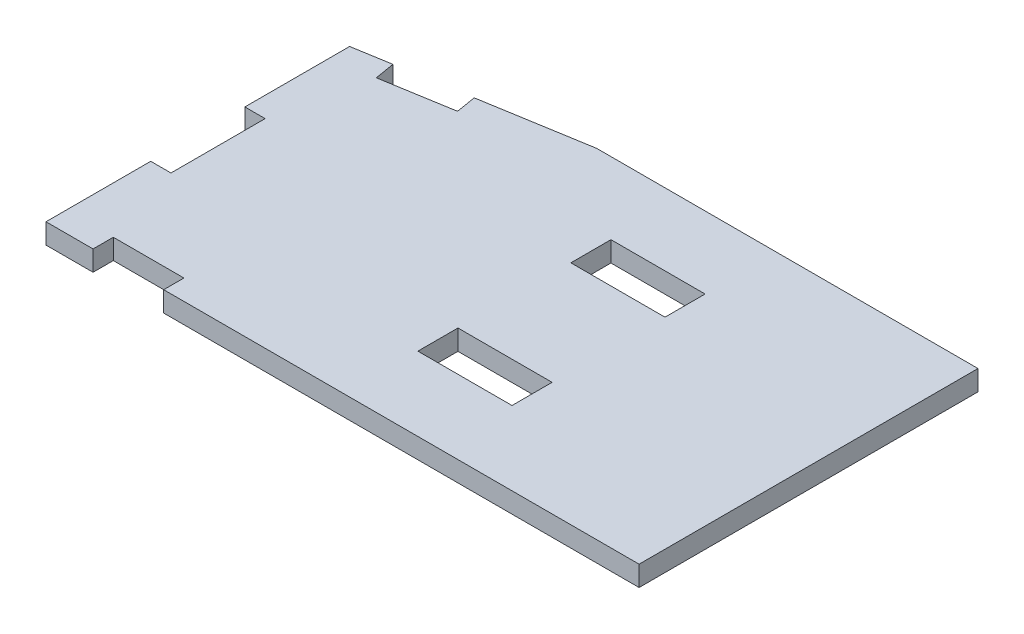
ISO-10303-21;
HEADER;
FILE_DESCRIPTION(('STEP AP214'),'2;1');
FILE_NAME('part.step','',(''),(''),'','','');
FILE_SCHEMA(('AUTOMOTIVE_DESIGN { 1 0 10303 214 1 1 1 1 }'));
ENDSEC;
DATA;
#1=APPLICATION_CONTEXT('core data for automotive mechanical design processes');
#2=APPLICATION_PROTOCOL_DEFINITION('international standard','automotive_design',2000,#1);
#3=PRODUCT_CONTEXT('',#1,'mechanical');
#4=PRODUCT('Part','Part','',(#3));
#5=PRODUCT_RELATED_PRODUCT_CATEGORY('part','',(#4));
#6=PRODUCT_DEFINITION_FORMATION('','',#4);
#7=PRODUCT_DEFINITION_CONTEXT('part definition',#1,'design');
#8=PRODUCT_DEFINITION('design','',#6,#7);
#9=PRODUCT_DEFINITION_SHAPE('','',#8);
#10=(LENGTH_UNIT() NAMED_UNIT(*) SI_UNIT(.MILLI.,.METRE.));
#11=(NAMED_UNIT(*) PLANE_ANGLE_UNIT() SI_UNIT($,.RADIAN.));
#12=(NAMED_UNIT(*) SI_UNIT($,.STERADIAN.) SOLID_ANGLE_UNIT());
#13=UNCERTAINTY_MEASURE_WITH_UNIT(LENGTH_MEASURE(1.E-05),#10,'distance_accuracy_value','');
#14=(GEOMETRIC_REPRESENTATION_CONTEXT(3) GLOBAL_UNCERTAINTY_ASSIGNED_CONTEXT((#13)) GLOBAL_UNIT_ASSIGNED_CONTEXT((#10,
#11,#12)) REPRESENTATION_CONTEXT('',''));
#15=CARTESIAN_POINT('',(0.,0.,0.));
#16=DIRECTION('',(0.,0.,1.));
#17=DIRECTION('',(1.,0.,0.));
#18=AXIS2_PLACEMENT_3D('',#15,#16,#17);
#19=CARTESIAN_POINT('',(-8.51529729729729,5.461,-51.0917837837838));
#20=DIRECTION('',(-0.164398987305357,0.,-0.986393923832144));
#21=DIRECTION('',(-0.986393923832144,0.,0.164398987305357));
#22=AXIS2_PLACEMENT_3D('',#19,#20,#21);
#23=PLANE('',#22);
#24=DIRECTION('',(0.,-1.,0.));
#25=VECTOR('',#24,1.);
#26=CARTESIAN_POINT('',(-70.6374334848631,5.461,-40.7380944191895));
#27=LINE('',#26,#25);
#28=CARTESIAN_POINT('',(-70.6374334848631,5.461,-40.7380944191895));
#29=VERTEX_POINT('',#28);
#30=CARTESIAN_POINT('',(-70.6374334848631,0.,-40.7380944191895));
#31=VERTEX_POINT('',#30);
#32=EDGE_CURVE('E291',#29,#31,#27,.T.);
#33=ORIENTED_EDGE('',*,*,#32,.F.);
#34=DIRECTION('',(0.986393923832144,0.,-0.164398987305357));
#35=VECTOR('',#34,1.);
#36=CARTESIAN_POINT('',(-8.51529729729729,5.461,-51.0917837837838));
#37=LINE('',#36,#35);
#38=CARTESIAN_POINT('',(-42.3,5.461,-45.461));
#39=VERTEX_POINT('',#38);
#40=EDGE_CURVE('E358',#29,#39,#37,.T.);
#41=ORIENTED_EDGE('',*,*,#40,.T.);
#42=DIRECTION('',(0.,-1.,0.));
#43=VECTOR('',#42,1.);
#44=CARTESIAN_POINT('',(-42.3,5.461,-45.461));
#45=LINE('',#44,#43);
#46=CARTESIAN_POINT('',(-42.3,0.,-45.461));
#47=VERTEX_POINT('',#46);
#48=EDGE_CURVE('E45',#39,#47,#45,.T.);
#49=ORIENTED_EDGE('',*,*,#48,.T.);
#50=DIRECTION('',(0.986393923832144,0.,-0.164398987305357));
#51=VECTOR('',#50,1.);
#52=CARTESIAN_POINT('',(-8.51529729729729,0.,-51.0917837837838));
#53=LINE('',#52,#51);
#54=EDGE_CURVE('E376',#31,#47,#53,.T.);
#55=ORIENTED_EDGE('',*,*,#54,.F.);
#56=EDGE_LOOP('',(#33,#41,#49,#55));
#57=FACE_BOUND('',#56,.T.);
#58=ADVANCED_FACE('F37',(#57),#23,.T.);
#59=CARTESIAN_POINT('',(-99.45,5.461,0.));
#60=DIRECTION('',(1.,0.,0.));
#61=DIRECTION('',(0.,0.,-1.));
#62=AXIS2_PLACEMENT_3D('',#59,#60,#61);
#63=PLANE('',#62);
#64=DIRECTION('',(0.,0.,1.));
#65=VECTOR('',#64,1.);
#66=CARTESIAN_POINT('',(-99.45,0.,0.));
#67=LINE('',#66,#65);
#68=CARTESIAN_POINT('',(-99.45,0.,-35.936));
#69=VERTEX_POINT('',#68);
#70=CARTESIAN_POINT('',(-99.45,0.,-7.67850000000001));
#71=VERTEX_POINT('',#70);
#72=EDGE_CURVE('E381',#69,#71,#67,.T.);
#73=ORIENTED_EDGE('',*,*,#72,.T.);
#74=DIRECTION('',(0.,-1.,0.));
#75=VECTOR('',#74,1.);
#76=CARTESIAN_POINT('',(-99.45,5.461,-7.67850000000001));
#77=LINE('',#76,#75);
#78=CARTESIAN_POINT('',(-99.45,5.461,-7.67850000000001));
#79=VERTEX_POINT('',#78);
#80=EDGE_CURVE('E287',#79,#71,#77,.T.);
#81=ORIENTED_EDGE('',*,*,#80,.F.);
#82=DIRECTION('',(0.,0.,1.));
#83=VECTOR('',#82,1.);
#84=CARTESIAN_POINT('',(-99.45,5.461,0.));
#85=LINE('',#84,#83);
#86=CARTESIAN_POINT('',(-99.45,5.461,-35.936));
#87=VERTEX_POINT('',#86);
#88=EDGE_CURVE('E363',#87,#79,#85,.T.);
#89=ORIENTED_EDGE('',*,*,#88,.F.);
#90=DIRECTION('',(0.,-1.,0.));
#91=VECTOR('',#90,1.);
#92=CARTESIAN_POINT('',(-99.45,5.461,-35.936));
#93=LINE('',#92,#91);
#94=EDGE_CURVE('E392',#87,#69,#93,.T.);
#95=ORIENTED_EDGE('',*,*,#94,.T.);
#96=EDGE_LOOP('',(#73,#81,#89,#95));
#97=FACE_BOUND('',#96,.T.);
#98=ADVANCED_FACE('F459',(#97),#63,.F.);
#99=CARTESIAN_POINT('',(0.,5.461,45.979));
#100=DIRECTION('',(0.,0.,-1.));
#101=DIRECTION('',(-1.,0.,0.));
#102=AXIS2_PLACEMENT_3D('',#99,#100,#101);
#103=PLANE('',#102);
#104=DIRECTION('',(1.,0.,0.));
#105=VECTOR('',#104,1.);
#106=CARTESIAN_POINT('',(0.,5.461,45.979));
#107=LINE('',#106,#105);
#108=CARTESIAN_POINT('',(-67.7,5.461,45.979));
#109=VERTEX_POINT('',#108);
#110=CARTESIAN_POINT('',(60.57,5.461,45.979));
#111=VERTEX_POINT('',#110);
#112=EDGE_CURVE('E366',#109,#111,#107,.T.);
#113=ORIENTED_EDGE('',*,*,#112,.F.);
#114=DIRECTION('',(0.,-1.,0.));
#115=VECTOR('',#114,1.);
#116=CARTESIAN_POINT('',(-67.7,5.461,45.979));
#117=LINE('',#116,#115);
#118=CARTESIAN_POINT('',(-67.7,0.,45.979));
#119=VERTEX_POINT('',#118);
#120=EDGE_CURVE('E337',#109,#119,#117,.T.);
#121=ORIENTED_EDGE('',*,*,#120,.T.);
#122=DIRECTION('',(1.,0.,0.));
#123=VECTOR('',#122,1.);
#124=CARTESIAN_POINT('',(0.,0.,45.979));
#125=LINE('',#124,#123);
#126=CARTESIAN_POINT('',(60.57,0.,45.979));
#127=VERTEX_POINT('',#126);
#128=EDGE_CURVE('E384',#119,#127,#125,.T.);
#129=ORIENTED_EDGE('',*,*,#128,.T.);
#130=DIRECTION('',(0.,-1.,0.));
#131=VECTOR('',#130,1.);
#132=CARTESIAN_POINT('',(60.57,5.461,45.979));
#133=LINE('',#132,#131);
#134=EDGE_CURVE('E370',#111,#127,#133,.T.);
#135=ORIENTED_EDGE('',*,*,#134,.F.);
#136=EDGE_LOOP('',(#113,#121,#129,#135));
#137=FACE_BOUND('',#136,.T.);
#138=ADVANCED_FACE('F422',(#137),#103,.F.);
#139=CARTESIAN_POINT('',(60.57,5.461,0.));
#140=DIRECTION('',(1.,0.,0.));
#141=DIRECTION('',(0.,0.,-1.));
#142=AXIS2_PLACEMENT_3D('',#139,#140,#141);
#143=PLANE('',#142);
#144=DIRECTION('',(0.,0.,1.));
#145=VECTOR('',#144,1.);
#146=CARTESIAN_POINT('',(60.57,0.,0.));
#147=LINE('',#146,#145);
#148=CARTESIAN_POINT('',(60.57,0.,-45.461));
#149=VERTEX_POINT('',#148);
#150=EDGE_CURVE('E293',#149,#127,#147,.T.);
#151=ORIENTED_EDGE('',*,*,#150,.F.);
#152=DIRECTION('',(0.,-1.,0.));
#153=VECTOR('',#152,1.);
#154=CARTESIAN_POINT('',(60.57,5.461,-45.461));
#155=LINE('',#154,#153);
#156=CARTESIAN_POINT('',(60.57,5.461,-45.461));
#157=VERTEX_POINT('',#156);
#158=EDGE_CURVE('E11',#157,#149,#155,.T.);
#159=ORIENTED_EDGE('',*,*,#158,.F.);
#160=DIRECTION('',(0.,0.,1.));
#161=VECTOR('',#160,1.);
#162=CARTESIAN_POINT('',(60.57,5.461,0.));
#163=LINE('',#162,#161);
#164=EDGE_CURVE('E351',#157,#111,#163,.T.);
#165=ORIENTED_EDGE('',*,*,#164,.T.);
#166=ORIENTED_EDGE('',*,*,#134,.T.);
#167=EDGE_LOOP('',(#151,#159,#165,#166));
#168=FACE_BOUND('',#167,.T.);
#169=ADVANCED_FACE('F39',(#168),#143,.T.);
#170=CARTESIAN_POINT('',(0.,5.461,-45.461));
#171=DIRECTION('',(0.,0.,-1.));
#172=DIRECTION('',(-1.,0.,0.));
#173=AXIS2_PLACEMENT_3D('',#170,#171,#172);
#174=PLANE('',#173);
#175=DIRECTION('',(1.,0.,0.));
#176=VECTOR('',#175,1.);
#177=CARTESIAN_POINT('',(0.,0.,-45.461));
#178=LINE('',#177,#176);
#179=EDGE_CURVE('E373',#47,#149,#178,.T.);
#180=ORIENTED_EDGE('',*,*,#179,.F.);
#181=ORIENTED_EDGE('',*,*,#48,.F.);
#182=DIRECTION('',(1.,0.,0.));
#183=VECTOR('',#182,1.);
#184=CARTESIAN_POINT('',(0.,5.461,-45.461));
#185=LINE('',#184,#183);
#186=EDGE_CURVE('E354',#39,#157,#185,.T.);
#187=ORIENTED_EDGE('',*,*,#186,.T.);
#188=ORIENTED_EDGE('',*,*,#158,.T.);
#189=EDGE_LOOP('',(#180,#181,#187,#188));
#190=FACE_BOUND('',#189,.T.);
#191=ADVANCED_FACE('F402',(#190),#174,.T.);
#192=DIRECTION('',(0.,-1.,0.));
#193=VECTOR('',#192,1.);
#194=CARTESIAN_POINT('',(-89.4282377338654,5.461,-37.6062937110224));
#195=LINE('',#194,#193);
#196=CARTESIAN_POINT('',(-89.4282377338654,5.461,-37.6062937110224));
#197=VERTEX_POINT('',#196);
#198=CARTESIAN_POINT('',(-89.4282377338654,0.,-37.6062937110224));
#199=VERTEX_POINT('',#198);
#200=EDGE_CURVE('E294',#197,#199,#195,.T.);
#201=ORIENTED_EDGE('',*,*,#200,.T.);
#202=EDGE_CURVE('E377',#69,#199,#53,.T.);
#203=ORIENTED_EDGE('',*,*,#202,.F.);
#204=ORIENTED_EDGE('',*,*,#94,.F.);
#205=EDGE_CURVE('E359',#87,#197,#37,.T.);
#206=ORIENTED_EDGE('',*,*,#205,.T.);
#207=EDGE_LOOP('',(#201,#203,#204,#206));
#208=FACE_BOUND('',#207,.T.);
#209=ADVANCED_FACE('F463',(#208),#23,.T.);
#210=CARTESIAN_POINT('',(-99.45,5.461,17.7215));
#211=VERTEX_POINT('',#210);
#212=CARTESIAN_POINT('',(-99.45,5.461,45.979));
#213=VERTEX_POINT('',#212);
#214=EDGE_CURVE('E362',#211,#213,#85,.T.);
#215=ORIENTED_EDGE('',*,*,#214,.F.);
#216=DIRECTION('',(0.,-1.,0.));
#217=VECTOR('',#216,1.);
#218=CARTESIAN_POINT('',(-99.45,5.461,17.7215));
#219=LINE('',#218,#217);
#220=CARTESIAN_POINT('',(-99.45,0.,17.7215));
#221=VERTEX_POINT('',#220);
#222=EDGE_CURVE('E320',#211,#221,#219,.T.);
#223=ORIENTED_EDGE('',*,*,#222,.T.);
#224=CARTESIAN_POINT('',(-99.45,0.,45.979));
#225=VERTEX_POINT('',#224);
#226=EDGE_CURVE('E380',#221,#225,#67,.T.);
#227=ORIENTED_EDGE('',*,*,#226,.T.);
#228=DIRECTION('',(0.,-1.,0.));
#229=VECTOR('',#228,1.);
#230=CARTESIAN_POINT('',(-99.45,5.461,45.979));
#231=LINE('',#230,#229);
#232=EDGE_CURVE('E389',#213,#225,#231,.T.);
#233=ORIENTED_EDGE('',*,*,#232,.F.);
#234=EDGE_LOOP('',(#215,#223,#227,#233));
#235=FACE_BOUND('',#234,.T.);
#236=ADVANCED_FACE('F443',(#235),#63,.F.);
#237=CARTESIAN_POINT('',(-86.75,0.,45.979));
#238=VERTEX_POINT('',#237);
#239=EDGE_CURVE('E355',#225,#238,#125,.T.);
#240=ORIENTED_EDGE('',*,*,#239,.T.);
#241=DIRECTION('',(0.,-1.,0.));
#242=VECTOR('',#241,1.);
#243=CARTESIAN_POINT('',(-86.75,5.461,45.979));
#244=LINE('',#243,#242);
#245=CARTESIAN_POINT('',(-86.75,5.461,45.979));
#246=VERTEX_POINT('',#245);
#247=EDGE_CURVE('E347',#246,#238,#244,.T.);
#248=ORIENTED_EDGE('',*,*,#247,.F.);
#249=EDGE_CURVE('E367',#213,#246,#107,.T.);
#250=ORIENTED_EDGE('',*,*,#249,.F.);
#251=ORIENTED_EDGE('',*,*,#232,.T.);
#252=EDGE_LOOP('',(#240,#248,#250,#251));
#253=FACE_BOUND('',#252,.T.);
#254=ADVANCED_FACE('F438',(#253),#103,.F.);
#255=CARTESIAN_POINT('',(0.,5.461,0.));
#256=DIRECTION('',(0.,1.,0.));
#257=DIRECTION('',(0.,0.,1.));
#258=AXIS2_PLACEMENT_3D('',#255,#256,#257);
#259=PLANE('',#258);
#260=DIRECTION('',(0.,0.,1.));
#261=VECTOR('',#260,1.);
#262=CARTESIAN_POINT('',(-19.05,5.461,26.0477));
#263=LINE('',#262,#261);
#264=CARTESIAN_POINT('',(-19.05,5.461,15.2273));
#265=VERTEX_POINT('',#264);
#266=CARTESIAN_POINT('',(-19.05,5.461,26.0477));
#267=VERTEX_POINT('',#266);
#268=EDGE_CURVE('E52',#265,#267,#263,.T.);
#269=ORIENTED_EDGE('',*,*,#268,.F.);
#270=DIRECTION('',(-1.,0.,0.));
#271=VECTOR('',#270,1.);
#272=CARTESIAN_POINT('',(6.34999999999999,5.461,15.2273));
#273=LINE('',#272,#271);
#274=CARTESIAN_POINT('',(6.34999999999999,5.461,15.2273));
#275=VERTEX_POINT('',#274);
#276=EDGE_CURVE('E224',#275,#265,#273,.T.);
#277=ORIENTED_EDGE('',*,*,#276,.F.);
#278=DIRECTION('',(0.,0.,-1.));
#279=VECTOR('',#278,1.);
#280=CARTESIAN_POINT('',(6.34999999999999,5.461,26.0477));
#281=LINE('',#280,#279);
#282=CARTESIAN_POINT('',(6.34999999999999,5.461,26.0477));
#283=VERTEX_POINT('',#282);
#284=EDGE_CURVE('E227',#283,#275,#281,.T.);
#285=ORIENTED_EDGE('',*,*,#284,.F.);
#286=DIRECTION('',(1.,0.,0.));
#287=VECTOR('',#286,1.);
#288=CARTESIAN_POINT('',(6.34999999999999,5.461,26.0477));
#289=LINE('',#288,#287);
#290=EDGE_CURVE('E233',#267,#283,#289,.T.);
#291=ORIENTED_EDGE('',*,*,#290,.F.);
#292=EDGE_LOOP('',(#269,#277,#285,#291));
#293=FACE_BOUND('',#292,.T.);
#294=DIRECTION('',(0.,0.,1.));
#295=VECTOR('',#294,1.);
#296=CARTESIAN_POINT('',(-19.05,5.461,-15.2273));
#297=LINE('',#296,#295);
#298=CARTESIAN_POINT('',(-19.05,5.461,-26.0477));
#299=VERTEX_POINT('',#298);
#300=CARTESIAN_POINT('',(-19.05,5.461,-15.2273));
#301=VERTEX_POINT('',#300);
#302=EDGE_CURVE('E60',#299,#301,#297,.T.);
#303=ORIENTED_EDGE('',*,*,#302,.F.);
#304=DIRECTION('',(-1.,0.,0.));
#305=VECTOR('',#304,1.);
#306=CARTESIAN_POINT('',(6.35,5.461,-26.0477));
#307=LINE('',#306,#305);
#308=CARTESIAN_POINT('',(6.35,5.461,-26.0477));
#309=VERTEX_POINT('',#308);
#310=EDGE_CURVE('E248',#309,#299,#307,.T.);
#311=ORIENTED_EDGE('',*,*,#310,.F.);
#312=DIRECTION('',(0.,0.,-1.));
#313=VECTOR('',#312,1.);
#314=CARTESIAN_POINT('',(6.34999999999999,5.461,-15.2273));
#315=LINE('',#314,#313);
#316=CARTESIAN_POINT('',(6.34999999999999,5.461,-15.2273));
#317=VERTEX_POINT('',#316);
#318=EDGE_CURVE('E262',#317,#309,#315,.T.);
#319=ORIENTED_EDGE('',*,*,#318,.F.);
#320=DIRECTION('',(1.,0.,0.));
#321=VECTOR('',#320,1.);
#322=CARTESIAN_POINT('',(6.34999999999999,5.461,-15.2273));
#323=LINE('',#322,#321);
#324=EDGE_CURVE('E259',#301,#317,#323,.T.);
#325=ORIENTED_EDGE('',*,*,#324,.F.);
#326=EDGE_LOOP('',(#303,#311,#319,#325));
#327=FACE_BOUND('',#326,.T.);
#328=DIRECTION('',(0.164398987305357,0.,0.986393923832144));
#329=VECTOR('',#328,1.);
#330=CARTESIAN_POINT('',(-70.6374334848631,5.461,-40.7380944191895));
#331=LINE('',#330,#329);
#332=CARTESIAN_POINT('',(-69.7396506151885,5.461,-35.3513972011422));
#333=VERTEX_POINT('',#332);
#334=EDGE_CURVE('E273',#29,#333,#331,.T.);
#335=ORIENTED_EDGE('',*,*,#334,.T.);
#336=DIRECTION('',(-0.986393923832144,0.,0.164398987305358));
#337=VECTOR('',#336,1.);
#338=CARTESIAN_POINT('',(-69.7396506151885,5.461,-35.3513972011422));
#339=LINE('',#338,#337);
#340=CARTESIAN_POINT('',(-88.5304548641909,5.461,-32.2195964929751));
#341=VERTEX_POINT('',#340);
#342=EDGE_CURVE('E276',#333,#341,#339,.T.);
#343=ORIENTED_EDGE('',*,*,#342,.T.);
#344=DIRECTION('',(-0.164398987305357,0.,-0.986393923832144));
#345=VECTOR('',#344,1.);
#346=CARTESIAN_POINT('',(-89.4282377338654,5.461,-37.6062937110224));
#347=LINE('',#346,#345);
#348=EDGE_CURVE('E280',#341,#197,#347,.T.);
#349=ORIENTED_EDGE('',*,*,#348,.T.);
#350=ORIENTED_EDGE('',*,*,#205,.F.);
#351=ORIENTED_EDGE('',*,*,#88,.T.);
#352=DIRECTION('',(1.,0.,0.));
#353=VECTOR('',#352,1.);
#354=CARTESIAN_POINT('',(-99.45,5.461,-7.67850000000001));
#355=LINE('',#354,#353);
#356=CARTESIAN_POINT('',(-93.989,5.461,-7.67850000000001));
#357=VERTEX_POINT('',#356);
#358=EDGE_CURVE('E301',#79,#357,#355,.T.);
#359=ORIENTED_EDGE('',*,*,#358,.T.);
#360=DIRECTION('',(0.,0.,1.));
#361=VECTOR('',#360,1.);
#362=CARTESIAN_POINT('',(-93.989,5.461,-7.67850000000001));
#363=LINE('',#362,#361);
#364=CARTESIAN_POINT('',(-93.989,5.461,17.7215));
#365=VERTEX_POINT('',#364);
#366=EDGE_CURVE('E304',#357,#365,#363,.T.);
#367=ORIENTED_EDGE('',*,*,#366,.T.);
#368=DIRECTION('',(-1.,0.,0.));
#369=VECTOR('',#368,1.);
#370=CARTESIAN_POINT('',(-99.45,5.461,17.7215));
#371=LINE('',#370,#369);
#372=EDGE_CURVE('E308',#365,#211,#371,.T.);
#373=ORIENTED_EDGE('',*,*,#372,.T.);
#374=ORIENTED_EDGE('',*,*,#214,.T.);
#375=ORIENTED_EDGE('',*,*,#249,.T.);
#376=DIRECTION('',(0.,0.,-1.));
#377=VECTOR('',#376,1.);
#378=CARTESIAN_POINT('',(-86.75,5.461,45.979));
#379=LINE('',#378,#377);
#380=CARTESIAN_POINT('',(-86.75,5.461,40.518));
#381=VERTEX_POINT('',#380);
#382=EDGE_CURVE('E330',#246,#381,#379,.T.);
#383=ORIENTED_EDGE('',*,*,#382,.T.);
#384=DIRECTION('',(1.,0.,0.));
#385=VECTOR('',#384,1.);
#386=CARTESIAN_POINT('',(-67.7,5.461,40.518));
#387=LINE('',#386,#385);
#388=CARTESIAN_POINT('',(-67.7,5.461,40.518));
#389=VERTEX_POINT('',#388);
#390=EDGE_CURVE('E334',#381,#389,#387,.T.);
#391=ORIENTED_EDGE('',*,*,#390,.T.);
#392=DIRECTION('',(0.,0.,1.));
#393=VECTOR('',#392,1.);
#394=CARTESIAN_POINT('',(-67.7,5.461,45.979));
#395=LINE('',#394,#393);
#396=EDGE_CURVE('E327',#389,#109,#395,.T.);
#397=ORIENTED_EDGE('',*,*,#396,.T.);
#398=ORIENTED_EDGE('',*,*,#112,.T.);
#399=ORIENTED_EDGE('',*,*,#164,.F.);
#400=ORIENTED_EDGE('',*,*,#186,.F.);
#401=ORIENTED_EDGE('',*,*,#40,.F.);
#402=EDGE_LOOP('',(#335,#343,#349,#350,#351,#359,#367,#373,#374,#375,#383,#391,#397,#398,#399,
#400,#401));
#403=FACE_BOUND('',#402,.T.);
#404=ADVANCED_FACE('F416',(#293,#327,#403),#259,.T.);
#405=CARTESIAN_POINT('',(0.,0.,0.));
#406=DIRECTION('',(0.,1.,0.));
#407=DIRECTION('',(0.,0.,1.));
#408=AXIS2_PLACEMENT_3D('',#405,#406,#407);
#409=PLANE('',#408);
#410=DIRECTION('',(-1.,0.,0.));
#411=VECTOR('',#410,1.);
#412=CARTESIAN_POINT('',(6.34999999999999,0.,15.2273));
#413=LINE('',#412,#411);
#414=CARTESIAN_POINT('',(6.34999999999999,0.,15.2273));
#415=VERTEX_POINT('',#414);
#416=CARTESIAN_POINT('',(-19.05,0.,15.2273));
#417=VERTEX_POINT('',#416);
#418=EDGE_CURVE('E211',#415,#417,#413,.T.);
#419=ORIENTED_EDGE('',*,*,#418,.T.);
#420=DIRECTION('',(0.,0.,1.));
#421=VECTOR('',#420,1.);
#422=CARTESIAN_POINT('',(-19.05,0.,26.0477));
#423=LINE('',#422,#421);
#424=CARTESIAN_POINT('',(-19.05,0.,26.0477));
#425=VERTEX_POINT('',#424);
#426=EDGE_CURVE('E205',#417,#425,#423,.T.);
#427=ORIENTED_EDGE('',*,*,#426,.T.);
#428=DIRECTION('',(1.,0.,0.));
#429=VECTOR('',#428,1.);
#430=CARTESIAN_POINT('',(6.34999999999999,0.,26.0477));
#431=LINE('',#430,#429);
#432=CARTESIAN_POINT('',(6.34999999999999,0.,26.0477));
#433=VERTEX_POINT('',#432);
#434=EDGE_CURVE('E215',#425,#433,#431,.T.);
#435=ORIENTED_EDGE('',*,*,#434,.T.);
#436=DIRECTION('',(0.,0.,-1.));
#437=VECTOR('',#436,1.);
#438=CARTESIAN_POINT('',(6.34999999999999,0.,26.0477));
#439=LINE('',#438,#437);
#440=EDGE_CURVE('E219',#433,#415,#439,.T.);
#441=ORIENTED_EDGE('',*,*,#440,.T.);
#442=EDGE_LOOP('',(#419,#427,#435,#441));
#443=FACE_BOUND('',#442,.T.);
#444=DIRECTION('',(-1.,0.,0.));
#445=VECTOR('',#444,1.);
#446=CARTESIAN_POINT('',(6.35,0.,-26.0477));
#447=LINE('',#446,#445);
#448=CARTESIAN_POINT('',(6.35,0.,-26.0477));
#449=VERTEX_POINT('',#448);
#450=CARTESIAN_POINT('',(-19.05,0.,-26.0477));
#451=VERTEX_POINT('',#450);
#452=EDGE_CURVE('E254',#449,#451,#447,.T.);
#453=ORIENTED_EDGE('',*,*,#452,.T.);
#454=DIRECTION('',(0.,0.,1.));
#455=VECTOR('',#454,1.);
#456=CARTESIAN_POINT('',(-19.05,0.,-15.2273));
#457=LINE('',#456,#455);
#458=CARTESIAN_POINT('',(-19.05,0.,-15.2273));
#459=VERTEX_POINT('',#458);
#460=EDGE_CURVE('E244',#451,#459,#457,.T.);
#461=ORIENTED_EDGE('',*,*,#460,.T.);
#462=DIRECTION('',(1.,0.,0.));
#463=VECTOR('',#462,1.);
#464=CARTESIAN_POINT('',(6.34999999999999,0.,-15.2273));
#465=LINE('',#464,#463);
#466=CARTESIAN_POINT('',(6.34999999999999,0.,-15.2273));
#467=VERTEX_POINT('',#466);
#468=EDGE_CURVE('E247',#459,#467,#465,.T.);
#469=ORIENTED_EDGE('',*,*,#468,.T.);
#470=DIRECTION('',(0.,0.,-1.));
#471=VECTOR('',#470,1.);
#472=CARTESIAN_POINT('',(6.34999999999999,0.,-15.2273));
#473=LINE('',#472,#471);
#474=EDGE_CURVE('E251',#467,#449,#473,.T.);
#475=ORIENTED_EDGE('',*,*,#474,.T.);
#476=EDGE_LOOP('',(#453,#461,#469,#475));
#477=FACE_BOUND('',#476,.T.);
#478=DIRECTION('',(-0.986393923832144,0.,0.164398987305358));
#479=VECTOR('',#478,1.);
#480=CARTESIAN_POINT('',(-69.7396506151885,0.,-35.3513972011422));
#481=LINE('',#480,#479);
#482=CARTESIAN_POINT('',(-69.7396506151885,0.,-35.3513972011421));
#483=VERTEX_POINT('',#482);
#484=CARTESIAN_POINT('',(-88.5304548641909,0.,-32.2195964929751));
#485=VERTEX_POINT('',#484);
#486=EDGE_CURVE('E286',#483,#485,#481,.T.);
#487=ORIENTED_EDGE('',*,*,#486,.F.);
#488=DIRECTION('',(0.164398987305357,0.,0.986393923832144));
#489=VECTOR('',#488,1.);
#490=CARTESIAN_POINT('',(-70.6374334848631,0.,-40.7380944191895));
#491=LINE('',#490,#489);
#492=EDGE_CURVE('E284',#31,#483,#491,.T.);
#493=ORIENTED_EDGE('',*,*,#492,.F.);
#494=ORIENTED_EDGE('',*,*,#54,.T.);
#495=ORIENTED_EDGE('',*,*,#179,.T.);
#496=ORIENTED_EDGE('',*,*,#150,.T.);
#497=ORIENTED_EDGE('',*,*,#128,.F.);
#498=DIRECTION('',(0.,0.,1.));
#499=VECTOR('',#498,1.);
#500=CARTESIAN_POINT('',(-67.7,0.,45.979));
#501=LINE('',#500,#499);
#502=CARTESIAN_POINT('',(-67.7,0.,40.518));
#503=VERTEX_POINT('',#502);
#504=EDGE_CURVE('E240',#503,#119,#501,.T.);
#505=ORIENTED_EDGE('',*,*,#504,.F.);
#506=DIRECTION('',(1.,0.,0.));
#507=VECTOR('',#506,1.);
#508=CARTESIAN_POINT('',(-67.7,0.,40.518));
#509=LINE('',#508,#507);
#510=CARTESIAN_POINT('',(-86.75,0.,40.518));
#511=VERTEX_POINT('',#510);
#512=EDGE_CURVE('E331',#511,#503,#509,.T.);
#513=ORIENTED_EDGE('',*,*,#512,.F.);
#514=DIRECTION('',(0.,0.,-1.));
#515=VECTOR('',#514,1.);
#516=CARTESIAN_POINT('',(-86.75,0.,45.979));
#517=LINE('',#516,#515);
#518=EDGE_CURVE('E339',#238,#511,#517,.T.);
#519=ORIENTED_EDGE('',*,*,#518,.F.);
#520=ORIENTED_EDGE('',*,*,#239,.F.);
#521=ORIENTED_EDGE('',*,*,#226,.F.);
#522=DIRECTION('',(-1.,0.,0.));
#523=VECTOR('',#522,1.);
#524=CARTESIAN_POINT('',(-99.45,0.,17.7215));
#525=LINE('',#524,#523);
#526=CARTESIAN_POINT('',(-93.989,0.,17.7215));
#527=VERTEX_POINT('',#526);
#528=EDGE_CURVE('E305',#527,#221,#525,.T.);
#529=ORIENTED_EDGE('',*,*,#528,.F.);
#530=DIRECTION('',(0.,0.,1.));
#531=VECTOR('',#530,1.);
#532=CARTESIAN_POINT('',(-93.989,0.,-7.67850000000001));
#533=LINE('',#532,#531);
#534=CARTESIAN_POINT('',(-93.989,0.,-7.67850000000001));
#535=VERTEX_POINT('',#534);
#536=EDGE_CURVE('E314',#535,#527,#533,.T.);
#537=ORIENTED_EDGE('',*,*,#536,.F.);
#538=DIRECTION('',(1.,0.,0.));
#539=VECTOR('',#538,1.);
#540=CARTESIAN_POINT('',(-99.45,0.,-7.67850000000001));
#541=LINE('',#540,#539);
#542=EDGE_CURVE('E312',#71,#535,#541,.T.);
#543=ORIENTED_EDGE('',*,*,#542,.F.);
#544=ORIENTED_EDGE('',*,*,#72,.F.);
#545=ORIENTED_EDGE('',*,*,#202,.T.);
#546=DIRECTION('',(-0.164398987305357,0.,-0.986393923832144));
#547=VECTOR('',#546,1.);
#548=CARTESIAN_POINT('',(-89.4282377338654,0.,-37.6062937110224));
#549=LINE('',#548,#547);
#550=EDGE_CURVE('E277',#485,#199,#549,.T.);
#551=ORIENTED_EDGE('',*,*,#550,.F.);
#552=EDGE_LOOP('',(#487,#493,#494,#495,#496,#497,#505,#513,#519,#520,#521,#529,#537,#543,#544,
#545,#551));
#553=FACE_BOUND('',#552,.T.);
#554=ADVANCED_FACE('F221',(#443,#477,#553),#409,.F.);
#555=CARTESIAN_POINT('',(-67.7,5.461,45.979));
#556=DIRECTION('',(1.,0.,0.));
#557=DIRECTION('',(0.,0.,-1.));
#558=AXIS2_PLACEMENT_3D('',#555,#556,#557);
#559=PLANE('',#558);
#560=ORIENTED_EDGE('',*,*,#504,.T.);
#561=ORIENTED_EDGE('',*,*,#120,.F.);
#562=ORIENTED_EDGE('',*,*,#396,.F.);
#563=DIRECTION('',(0.,-1.,0.));
#564=VECTOR('',#563,1.);
#565=CARTESIAN_POINT('',(-67.7,5.461,40.518));
#566=LINE('',#565,#564);
#567=EDGE_CURVE('E315',#389,#503,#566,.T.);
#568=ORIENTED_EDGE('',*,*,#567,.T.);
#569=EDGE_LOOP('',(#560,#561,#562,#568));
#570=FACE_BOUND('',#569,.T.);
#571=ADVANCED_FACE('F427',(#570),#559,.F.);
#572=CARTESIAN_POINT('',(-67.7,5.461,40.518));
#573=DIRECTION('',(0.,0.,-1.));
#574=DIRECTION('',(-1.,0.,0.));
#575=AXIS2_PLACEMENT_3D('',#572,#573,#574);
#576=PLANE('',#575);
#577=ORIENTED_EDGE('',*,*,#512,.T.);
#578=ORIENTED_EDGE('',*,*,#567,.F.);
#579=ORIENTED_EDGE('',*,*,#390,.F.);
#580=DIRECTION('',(0.,-1.,0.));
#581=VECTOR('',#580,1.);
#582=CARTESIAN_POINT('',(-86.75,5.461,40.518));
#583=LINE('',#582,#581);
#584=EDGE_CURVE('E345',#381,#511,#583,.T.);
#585=ORIENTED_EDGE('',*,*,#584,.T.);
#586=EDGE_LOOP('',(#577,#578,#579,#585));
#587=FACE_BOUND('',#586,.T.);
#588=ADVANCED_FACE('F431',(#587),#576,.F.);
#589=CARTESIAN_POINT('',(-86.75,5.461,45.979));
#590=DIRECTION('',(-1.,0.,0.));
#591=DIRECTION('',(0.,0.,1.));
#592=AXIS2_PLACEMENT_3D('',#589,#590,#591);
#593=PLANE('',#592);
#594=ORIENTED_EDGE('',*,*,#518,.T.);
#595=ORIENTED_EDGE('',*,*,#584,.F.);
#596=ORIENTED_EDGE('',*,*,#382,.F.);
#597=ORIENTED_EDGE('',*,*,#247,.T.);
#598=EDGE_LOOP('',(#594,#595,#596,#597));
#599=FACE_BOUND('',#598,.T.);
#600=ADVANCED_FACE('F433',(#599),#593,.F.);
#601=CARTESIAN_POINT('',(-99.45,5.461,-7.67850000000001));
#602=DIRECTION('',(0.,0.,-1.));
#603=DIRECTION('',(-1.,0.,0.));
#604=AXIS2_PLACEMENT_3D('',#601,#602,#603);
#605=PLANE('',#604);
#606=ORIENTED_EDGE('',*,*,#542,.T.);
#607=DIRECTION('',(0.,-1.,0.));
#608=VECTOR('',#607,1.);
#609=CARTESIAN_POINT('',(-93.989,5.461,-7.67850000000001));
#610=LINE('',#609,#608);
#611=EDGE_CURVE('E311',#357,#535,#610,.T.);
#612=ORIENTED_EDGE('',*,*,#611,.F.);
#613=ORIENTED_EDGE('',*,*,#358,.F.);
#614=ORIENTED_EDGE('',*,*,#80,.T.);
#615=EDGE_LOOP('',(#606,#612,#613,#614));
#616=FACE_BOUND('',#615,.T.);
#617=ADVANCED_FACE('F454',(#616),#605,.F.);
#618=CARTESIAN_POINT('',(-99.45,5.461,17.7215));
#619=DIRECTION('',(0.,0.,1.));
#620=DIRECTION('',(1.,0.,0.));
#621=AXIS2_PLACEMENT_3D('',#618,#619,#620);
#622=PLANE('',#621);
#623=ORIENTED_EDGE('',*,*,#528,.T.);
#624=ORIENTED_EDGE('',*,*,#222,.F.);
#625=ORIENTED_EDGE('',*,*,#372,.F.);
#626=DIRECTION('',(0.,-1.,0.));
#627=VECTOR('',#626,1.);
#628=CARTESIAN_POINT('',(-93.989,5.461,17.7215));
#629=LINE('',#628,#627);
#630=EDGE_CURVE('E323',#365,#527,#629,.T.);
#631=ORIENTED_EDGE('',*,*,#630,.T.);
#632=EDGE_LOOP('',(#623,#624,#625,#631));
#633=FACE_BOUND('',#632,.T.);
#634=ADVANCED_FACE('F448',(#633),#622,.F.);
#635=CARTESIAN_POINT('',(-93.989,5.461,-7.67850000000001));
#636=DIRECTION('',(1.,0.,0.));
#637=DIRECTION('',(0.,0.,-1.));
#638=AXIS2_PLACEMENT_3D('',#635,#636,#637);
#639=PLANE('',#638);
#640=ORIENTED_EDGE('',*,*,#536,.T.);
#641=ORIENTED_EDGE('',*,*,#630,.F.);
#642=ORIENTED_EDGE('',*,*,#366,.F.);
#643=ORIENTED_EDGE('',*,*,#611,.T.);
#644=EDGE_LOOP('',(#640,#641,#642,#643));
#645=FACE_BOUND('',#644,.T.);
#646=ADVANCED_FACE('F452',(#645),#639,.F.);
#647=CARTESIAN_POINT('',(-70.6374334848631,5.461,-40.7380944191895));
#648=DIRECTION('',(0.986393923832144,0.,-0.164398987305357));
#649=DIRECTION('',(-0.164398987305357,0.,-0.986393923832144));
#650=AXIS2_PLACEMENT_3D('',#647,#648,#649);
#651=PLANE('',#650);
#652=ORIENTED_EDGE('',*,*,#492,.T.);
#653=DIRECTION('',(0.,-1.,0.));
#654=VECTOR('',#653,1.);
#655=CARTESIAN_POINT('',(-69.7396506151885,5.461,-35.3513972011422));
#656=LINE('',#655,#654);
#657=EDGE_CURVE('E283',#333,#483,#656,.T.);
#658=ORIENTED_EDGE('',*,*,#657,.F.);
#659=ORIENTED_EDGE('',*,*,#334,.F.);
#660=ORIENTED_EDGE('',*,*,#32,.T.);
#661=EDGE_LOOP('',(#652,#658,#659,#660));
#662=FACE_BOUND('',#661,.T.);
#663=ADVANCED_FACE('F410',(#662),#651,.F.);
#664=CARTESIAN_POINT('',(-89.4282377338654,5.461,-37.6062937110224));
#665=DIRECTION('',(-0.986393923832144,0.,0.164398987305357));
#666=DIRECTION('',(0.164398987305357,0.,0.986393923832144));
#667=AXIS2_PLACEMENT_3D('',#664,#665,#666);
#668=PLANE('',#667);
#669=ORIENTED_EDGE('',*,*,#550,.T.);
#670=ORIENTED_EDGE('',*,*,#200,.F.);
#671=ORIENTED_EDGE('',*,*,#348,.F.);
#672=DIRECTION('',(0.,-1.,0.));
#673=VECTOR('',#672,1.);
#674=CARTESIAN_POINT('',(-88.5304548641909,5.461,-32.2195964929751));
#675=LINE('',#674,#673);
#676=EDGE_CURVE('E297',#341,#485,#675,.T.);
#677=ORIENTED_EDGE('',*,*,#676,.T.);
#678=EDGE_LOOP('',(#669,#670,#671,#677));
#679=FACE_BOUND('',#678,.T.);
#680=ADVANCED_FACE('F465',(#679),#668,.F.);
#681=CARTESIAN_POINT('',(-69.7396506151885,5.461,-35.3513972011422));
#682=DIRECTION('',(0.164398987305358,0.,0.986393923832144));
#683=DIRECTION('',(0.986393923832144,0.,-0.164398987305358));
#684=AXIS2_PLACEMENT_3D('',#681,#682,#683);
#685=PLANE('',#684);
#686=ORIENTED_EDGE('',*,*,#486,.T.);
#687=ORIENTED_EDGE('',*,*,#676,.F.);
#688=ORIENTED_EDGE('',*,*,#342,.F.);
#689=ORIENTED_EDGE('',*,*,#657,.T.);
#690=EDGE_LOOP('',(#686,#687,#688,#689));
#691=FACE_BOUND('',#690,.T.);
#692=ADVANCED_FACE('F413',(#691),#685,.F.);
#693=CARTESIAN_POINT('',(-19.05,0.,-15.2273));
#694=DIRECTION('',(-1.,0.,0.));
#695=DIRECTION('',(0.,0.,1.));
#696=AXIS2_PLACEMENT_3D('',#693,#694,#695);
#697=PLANE('',#696);
#698=ORIENTED_EDGE('',*,*,#302,.T.);
#699=DIRECTION('',(0.,1.,0.));
#700=VECTOR('',#699,1.);
#701=CARTESIAN_POINT('',(-19.05,0.,-15.2273));
#702=LINE('',#701,#700);
#703=EDGE_CURVE('E257',#459,#301,#702,.T.);
#704=ORIENTED_EDGE('',*,*,#703,.F.);
#705=ORIENTED_EDGE('',*,*,#460,.F.);
#706=DIRECTION('',(0.,1.,0.));
#707=VECTOR('',#706,1.);
#708=CARTESIAN_POINT('',(-19.05,0.,-26.0477));
#709=LINE('',#708,#707);
#710=EDGE_CURVE('E234',#451,#299,#709,.T.);
#711=ORIENTED_EDGE('',*,*,#710,.T.);
#712=EDGE_LOOP('',(#698,#704,#705,#711));
#713=FACE_BOUND('',#712,.T.);
#714=ADVANCED_FACE('F472',(#713),#697,.F.);
#715=CARTESIAN_POINT('',(6.35,0.,-26.0477));
#716=DIRECTION('',(0.,0.,-1.));
#717=DIRECTION('',(-1.,0.,0.));
#718=AXIS2_PLACEMENT_3D('',#715,#716,#717);
#719=PLANE('',#718);
#720=ORIENTED_EDGE('',*,*,#310,.T.);
#721=ORIENTED_EDGE('',*,*,#710,.F.);
#722=ORIENTED_EDGE('',*,*,#452,.F.);
#723=DIRECTION('',(0.,1.,0.));
#724=VECTOR('',#723,1.);
#725=CARTESIAN_POINT('',(6.35,0.,-26.0477));
#726=LINE('',#725,#724);
#727=EDGE_CURVE('E268',#449,#309,#726,.T.);
#728=ORIENTED_EDGE('',*,*,#727,.T.);
#729=EDGE_LOOP('',(#720,#721,#722,#728));
#730=FACE_BOUND('',#729,.T.);
#731=ADVANCED_FACE('F563',(#730),#719,.F.);
#732=CARTESIAN_POINT('',(6.34999999999999,0.,-15.2273));
#733=DIRECTION('',(1.,0.,0.));
#734=DIRECTION('',(0.,0.,-1.));
#735=AXIS2_PLACEMENT_3D('',#732,#733,#734);
#736=PLANE('',#735);
#737=ORIENTED_EDGE('',*,*,#318,.T.);
#738=ORIENTED_EDGE('',*,*,#727,.F.);
#739=ORIENTED_EDGE('',*,*,#474,.F.);
#740=DIRECTION('',(0.,1.,0.));
#741=VECTOR('',#740,1.);
#742=CARTESIAN_POINT('',(6.34999999999999,0.,-15.2273));
#743=LINE('',#742,#741);
#744=EDGE_CURVE('E270',#467,#317,#743,.T.);
#745=ORIENTED_EDGE('',*,*,#744,.T.);
#746=EDGE_LOOP('',(#737,#738,#739,#745));
#747=FACE_BOUND('',#746,.T.);
#748=ADVANCED_FACE('F571',(#747),#736,.F.);
#749=CARTESIAN_POINT('',(6.34999999999999,0.,-15.2273));
#750=DIRECTION('',(0.,0.,1.));
#751=DIRECTION('',(1.,0.,0.));
#752=AXIS2_PLACEMENT_3D('',#749,#750,#751);
#753=PLANE('',#752);
#754=ORIENTED_EDGE('',*,*,#324,.T.);
#755=ORIENTED_EDGE('',*,*,#744,.F.);
#756=ORIENTED_EDGE('',*,*,#468,.F.);
#757=ORIENTED_EDGE('',*,*,#703,.T.);
#758=EDGE_LOOP('',(#754,#755,#756,#757));
#759=FACE_BOUND('',#758,.T.);
#760=ADVANCED_FACE('F581',(#759),#753,.F.);
#761=CARTESIAN_POINT('',(-19.05,0.,26.0477));
#762=DIRECTION('',(-1.,0.,0.));
#763=DIRECTION('',(0.,0.,1.));
#764=AXIS2_PLACEMENT_3D('',#761,#762,#763);
#765=PLANE('',#764);
#766=ORIENTED_EDGE('',*,*,#268,.T.);
#767=DIRECTION('',(0.,1.,0.));
#768=VECTOR('',#767,1.);
#769=CARTESIAN_POINT('',(-19.05,0.,26.0477));
#770=LINE('',#769,#768);
#771=EDGE_CURVE('E201',#425,#267,#770,.T.);
#772=ORIENTED_EDGE('',*,*,#771,.F.);
#773=ORIENTED_EDGE('',*,*,#426,.F.);
#774=DIRECTION('',(0.,1.,0.));
#775=VECTOR('',#774,1.);
#776=CARTESIAN_POINT('',(-19.05,0.,15.2273));
#777=LINE('',#776,#775);
#778=EDGE_CURVE('E238',#417,#265,#777,.T.);
#779=ORIENTED_EDGE('',*,*,#778,.T.);
#780=EDGE_LOOP('',(#766,#772,#773,#779));
#781=FACE_BOUND('',#780,.T.);
#782=ADVANCED_FACE('F203',(#781),#765,.F.);
#783=CARTESIAN_POINT('',(6.34999999999999,0.,15.2273));
#784=DIRECTION('',(0.,0.,-1.));
#785=DIRECTION('',(-1.,0.,0.));
#786=AXIS2_PLACEMENT_3D('',#783,#784,#785);
#787=PLANE('',#786);
#788=ORIENTED_EDGE('',*,*,#276,.T.);
#789=ORIENTED_EDGE('',*,*,#778,.F.);
#790=ORIENTED_EDGE('',*,*,#418,.F.);
#791=DIRECTION('',(0.,1.,0.));
#792=VECTOR('',#791,1.);
#793=CARTESIAN_POINT('',(6.34999999999999,0.,15.2273));
#794=LINE('',#793,#792);
#795=EDGE_CURVE('E241',#415,#275,#794,.T.);
#796=ORIENTED_EDGE('',*,*,#795,.T.);
#797=EDGE_LOOP('',(#788,#789,#790,#796));
#798=FACE_BOUND('',#797,.T.);
#799=ADVANCED_FACE('F600',(#798),#787,.F.);
#800=CARTESIAN_POINT('',(6.34999999999999,0.,26.0477));
#801=DIRECTION('',(1.,0.,0.));
#802=DIRECTION('',(0.,0.,-1.));
#803=AXIS2_PLACEMENT_3D('',#800,#801,#802);
#804=PLANE('',#803);
#805=ORIENTED_EDGE('',*,*,#284,.T.);
#806=ORIENTED_EDGE('',*,*,#795,.F.);
#807=ORIENTED_EDGE('',*,*,#440,.F.);
#808=DIRECTION('',(0.,1.,0.));
#809=VECTOR('',#808,1.);
#810=CARTESIAN_POINT('',(6.34999999999999,0.,26.0477));
#811=LINE('',#810,#809);
#812=EDGE_CURVE('E210',#433,#283,#811,.T.);
#813=ORIENTED_EDGE('',*,*,#812,.T.);
#814=EDGE_LOOP('',(#805,#806,#807,#813));
#815=FACE_BOUND('',#814,.T.);
#816=ADVANCED_FACE('F609',(#815),#804,.F.);
#817=CARTESIAN_POINT('',(6.34999999999999,0.,26.0477));
#818=DIRECTION('',(0.,0.,1.));
#819=DIRECTION('',(1.,0.,0.));
#820=AXIS2_PLACEMENT_3D('',#817,#818,#819);
#821=PLANE('',#820);
#822=ORIENTED_EDGE('',*,*,#290,.T.);
#823=ORIENTED_EDGE('',*,*,#812,.F.);
#824=ORIENTED_EDGE('',*,*,#434,.F.);
#825=ORIENTED_EDGE('',*,*,#771,.T.);
#826=EDGE_LOOP('',(#822,#823,#824,#825));
#827=FACE_BOUND('',#826,.T.);
#828=ADVANCED_FACE('F216',(#827),#821,.F.);
#829=CLOSED_SHELL('',(#58,#98,#138,#169,#191,#209,#236,#254,#404,#554,#571,#588,#600,#617,#634,
#646,#663,#680,#692,#714,#731,#748,#760,#782,#799,#816,#828));
#830=MANIFOLD_SOLID_BREP('B2',#829);
#831=ADVANCED_BREP_SHAPE_REPRESENTATION('',(#18,#830),#14);
#832=SHAPE_DEFINITION_REPRESENTATION(#9,#831);
ENDSEC;
END-ISO-10303-21;
